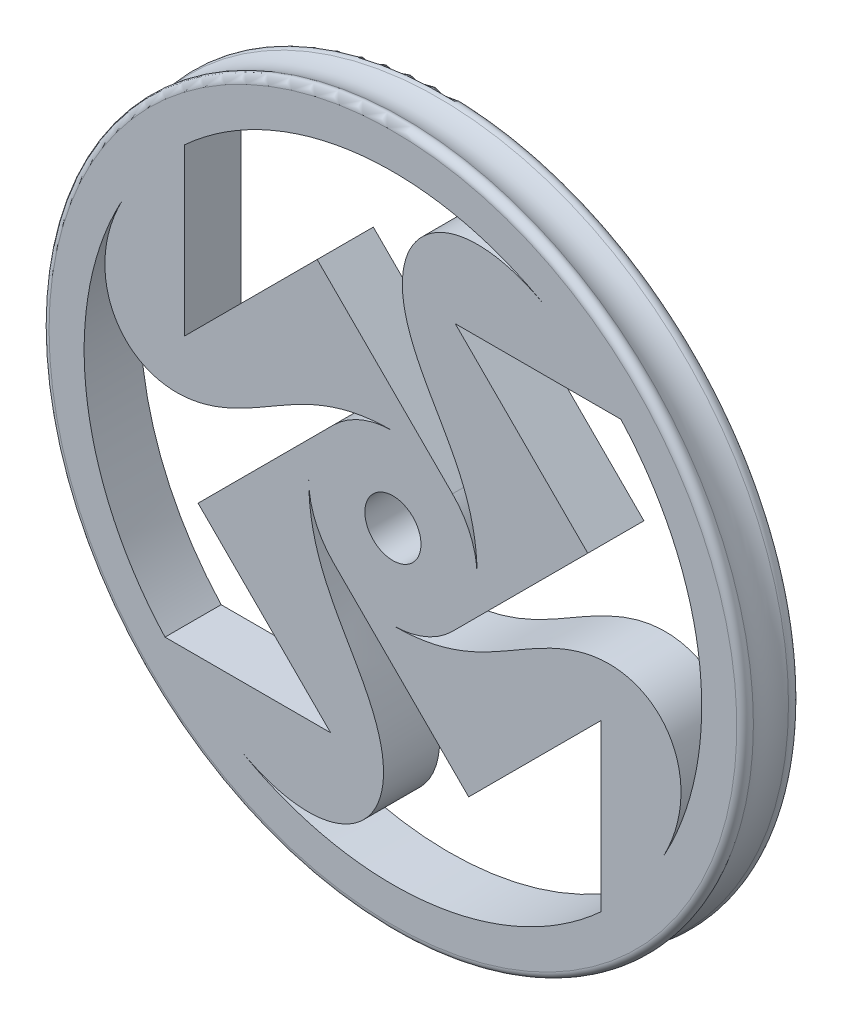
ISO-10303-21;
HEADER;
FILE_DESCRIPTION(('STEP AP214'),'2;1');
FILE_NAME('part.step','',(''),(''),'','','');
FILE_SCHEMA(('AUTOMOTIVE_DESIGN { 1 0 10303 214 1 1 1 1 }'));
ENDSEC;
DATA;
#1=APPLICATION_CONTEXT('core data for automotive mechanical design processes');
#2=APPLICATION_PROTOCOL_DEFINITION('international standard','automotive_design',2000,#1);
#3=PRODUCT_CONTEXT('',#1,'mechanical');
#4=PRODUCT('Part','Part','',(#3));
#5=PRODUCT_RELATED_PRODUCT_CATEGORY('part','',(#4));
#6=PRODUCT_DEFINITION_FORMATION('','',#4);
#7=PRODUCT_DEFINITION_CONTEXT('part definition',#1,'design');
#8=PRODUCT_DEFINITION('design','',#6,#7);
#9=PRODUCT_DEFINITION_SHAPE('','',#8);
#10=(LENGTH_UNIT() NAMED_UNIT(*) SI_UNIT(.MILLI.,.METRE.));
#11=(NAMED_UNIT(*) PLANE_ANGLE_UNIT() SI_UNIT($,.RADIAN.));
#12=(NAMED_UNIT(*) SI_UNIT($,.STERADIAN.) SOLID_ANGLE_UNIT());
#13=UNCERTAINTY_MEASURE_WITH_UNIT(LENGTH_MEASURE(1.E-05),#10,'distance_accuracy_value','');
#14=(GEOMETRIC_REPRESENTATION_CONTEXT(3) GLOBAL_UNCERTAINTY_ASSIGNED_CONTEXT((#13)) GLOBAL_UNIT_ASSIGNED_CONTEXT((#10,
#11,#12)) REPRESENTATION_CONTEXT('',''));
#15=CARTESIAN_POINT('',(0.,0.,0.));
#16=DIRECTION('',(0.,0.,1.));
#17=DIRECTION('',(1.,0.,0.));
#18=AXIS2_PLACEMENT_3D('',#15,#16,#17);
#19=CARTESIAN_POINT('',(0.,3.175,3.175));
#20=DIRECTION('',(0.,0.,1.));
#21=DIRECTION('',(1.,0.,0.));
#22=AXIS2_PLACEMENT_3D('',#19,#20,#21);
#23=PLANE('',#22);
#24=CARTESIAN_POINT('',(0.,0.,3.175));
#25=DIRECTION('',(0.,0.,-1.));
#26=DIRECTION('',(-1.,0.,0.));
#27=AXIS2_PLACEMENT_3D('',#24,#25,#26);
#28=CIRCLE('',#27,3.175);
#29=CARTESIAN_POINT('',(-3.175,0.,3.175));
#30=VERTEX_POINT('',#29);
#31=EDGE_CURVE('E654',#30,#30,#28,.T.);
#32=ORIENTED_EDGE('',*,*,#31,.T.);
#33=EDGE_LOOP('',(#32));
#34=FACE_BOUND('',#33,.T.);
#35=CARTESIAN_POINT('',(0.,0.,3.175));
#36=DIRECTION('',(0.,0.,-1.));
#37=DIRECTION('',(-1.,0.,0.));
#38=AXIS2_PLACEMENT_3D('',#35,#36,#37);
#39=CIRCLE('',#38,38.8968040144766);
#40=CARTESIAN_POINT('',(-38.8968040144766,0.,3.175));
#41=VERTEX_POINT('',#40);
#42=EDGE_CURVE('E12',#41,#41,#39,.T.);
#43=ORIENTED_EDGE('',*,*,#42,.F.);
#44=EDGE_LOOP('',(#43));
#45=FACE_BOUND('',#44,.T.);
#46=CARTESIAN_POINT('',(9.52499999999995,0.,3.175));
#47=CARTESIAN_POINT('',(9.525,16.3007800043497,3.175));
#48=CARTESIAN_POINT('',(-3.7537858617503,16.3007800043497,3.175));
#49=CARTESIAN_POINT('',(-3.75378586175031,32.5859301636656,3.175));
#50=CARTESIAN_POINT('',(6.85977902949857,36.4836641711056,3.175));
#51=CARTESIAN_POINT('',(17.7066361160398,30.1036652661126,3.175));
#52=B_SPLINE_CURVE_WITH_KNOTS('',5,(#46,#47,#48,#49,#50,#51),.UNSPECIFIED.,.F.,.F.,(6,6),(0.,
1.),.UNSPECIFIED.);
#53=CARTESIAN_POINT('',(9.52499999999995,0.,3.175));
#54=VERTEX_POINT('',#53);
#55=CARTESIAN_POINT('',(17.7066361160398,30.1036652661126,3.175));
#56=VERTEX_POINT('',#55);
#57=EDGE_CURVE('E624',#54,#56,#52,.T.);
#58=ORIENTED_EDGE('',*,*,#57,.F.);
#59=CARTESIAN_POINT('',(0.,0.,3.175));
#60=DIRECTION('',(0.,0.,1.));
#61=DIRECTION('',(1.,0.,0.));
#62=AXIS2_PLACEMENT_3D('',#59,#60,#61);
#63=CIRCLE('',#62,9.525);
#64=CARTESIAN_POINT('',(6.73519209080077,6.73519209080086,3.175));
#65=VERTEX_POINT('',#64);
#66=EDGE_CURVE('E620',#54,#65,#63,.T.);
#67=ORIENTED_EDGE('',*,*,#66,.T.);
#68=DIRECTION('',(-0.707106781186552,0.707106781186543,0.));
#69=VECTOR('',#68,1.);
#70=CARTESIAN_POINT('',(6.73519209080077,6.73519209080086,3.175));
#71=LINE('',#70,#69);
#72=CARTESIAN_POINT('',(-8.56875455638826,22.0391387379897,3.175));
#73=VERTEX_POINT('',#72);
#74=EDGE_CURVE('E646',#65,#73,#71,.T.);
#75=ORIENTED_EDGE('',*,*,#74,.T.);
#76=DIRECTION('',(-0.707106781186543,-0.707106781186552,0.));
#77=VECTOR('',#76,1.);
#78=CARTESIAN_POINT('',(-15.303946647189,15.3039466471888,3.175));
#79=LINE('',#78,#77);
#80=CARTESIAN_POINT('',(-23.5603588031436,7.04753449123411,3.175));
#81=VERTEX_POINT('',#80);
#82=EDGE_CURVE('E642',#73,#81,#79,.T.);
#83=ORIENTED_EDGE('',*,*,#82,.T.);
#84=DIRECTION('',(0.,1.,0.));
#85=VECTOR('',#84,1.);
#86=CARTESIAN_POINT('',(-23.5603588031436,0.,3.175));
#87=LINE('',#86,#85);
#88=CARTESIAN_POINT('',(-23.5603588031436,25.7811000166232,3.175));
#89=VERTEX_POINT('',#88);
#90=EDGE_CURVE('E638',#81,#89,#87,.T.);
#91=ORIENTED_EDGE('',*,*,#90,.T.);
#92=CARTESIAN_POINT('',(0.,0.,3.175));
#93=DIRECTION('',(0.,0.,1.));
#94=DIRECTION('',(1.,0.,0.));
#95=AXIS2_PLACEMENT_3D('',#92,#93,#94);
#96=CIRCLE('',#95,34.925);
#97=EDGE_CURVE('E631',#56,#89,#96,.T.);
#98=ORIENTED_EDGE('',*,*,#97,.F.);
#99=EDGE_LOOP('',(#58,#67,#75,#83,#91,#98));
#100=FACE_BOUND('',#99,.T.);
#101=CARTESIAN_POINT('',(-1.05150776711735E-12,9.5249999999989,3.175));
#102=CARTESIAN_POINT('',(-16.3007800043508,9.52499999999895,3.175));
#103=CARTESIAN_POINT('',(-16.3007800043508,-3.75378586175136,3.175));
#104=CARTESIAN_POINT('',(-32.5859301636666,-3.75378586175136,3.175));
#105=CARTESIAN_POINT('',(-36.4836641711066,6.85977902949752,3.175));
#106=CARTESIAN_POINT('',(-30.1036652661137,17.7066361160387,3.175));
#107=B_SPLINE_CURVE_WITH_KNOTS('',5,(#101,#102,#103,#104,#105,#106),.UNSPECIFIED.,.F.,.F.,(6,6),
(0.,1.),.UNSPECIFIED.);
#108=CARTESIAN_POINT('',(-1.05150776711735E-12,9.5249999999989,3.175));
#109=VERTEX_POINT('',#108);
#110=CARTESIAN_POINT('',(-30.1036652661133,17.7066361160385,3.175));
#111=VERTEX_POINT('',#110);
#112=EDGE_CURVE('E715',#109,#111,#107,.T.);
#113=ORIENTED_EDGE('',*,*,#112,.F.);
#114=CARTESIAN_POINT('',(0.,0.,3.175));
#115=DIRECTION('',(0.,0.,1.));
#116=DIRECTION('',(1.,0.,0.));
#117=AXIS2_PLACEMENT_3D('',#114,#115,#116);
#118=CIRCLE('',#117,9.525);
#119=CARTESIAN_POINT('',(-6.73519209080191,6.73519209079972,3.175));
#120=VERTEX_POINT('',#119);
#121=EDGE_CURVE('E403',#109,#120,#118,.T.);
#122=ORIENTED_EDGE('',*,*,#121,.T.);
#123=DIRECTION('',(-0.707106781186543,-0.707106781186552,0.));
#124=VECTOR('',#123,1.);
#125=CARTESIAN_POINT('',(-6.73519209080086,6.73519209080077,3.175));
#126=LINE('',#125,#124);
#127=CARTESIAN_POINT('',(-22.0391387379907,-8.56875455638932,3.175));
#128=VERTEX_POINT('',#127);
#129=EDGE_CURVE('E425',#120,#128,#126,.T.);
#130=ORIENTED_EDGE('',*,*,#129,.T.);
#131=DIRECTION('',(0.707106781186552,-0.707106781186543,0.));
#132=VECTOR('',#131,1.);
#133=CARTESIAN_POINT('',(-15.3039466471899,-15.3039466471901,3.175));
#134=LINE('',#133,#132);
#135=CARTESIAN_POINT('',(-7.04753449123517,-23.5603588031447,3.175));
#136=VERTEX_POINT('',#135);
#137=EDGE_CURVE('E429',#128,#136,#134,.T.);
#138=ORIENTED_EDGE('',*,*,#137,.T.);
#139=DIRECTION('',(-1.,0.,0.));
#140=VECTOR('',#139,1.);
#141=CARTESIAN_POINT('',(0.,-23.5603588031447,3.175));
#142=LINE('',#141,#140);
#143=CARTESIAN_POINT('',(-25.7811000166242,-23.5603588031447,3.175));
#144=VERTEX_POINT('',#143);
#145=EDGE_CURVE('E768',#136,#144,#142,.T.);
#146=ORIENTED_EDGE('',*,*,#145,.T.);
#147=CARTESIAN_POINT('',(0.,0.,3.175));
#148=DIRECTION('',(0.,0.,1.));
#149=DIRECTION('',(1.,0.,0.));
#150=AXIS2_PLACEMENT_3D('',#147,#148,#149);
#151=CIRCLE('',#150,34.925);
#152=EDGE_CURVE('E762',#111,#144,#151,.T.);
#153=ORIENTED_EDGE('',*,*,#152,.F.);
#154=EDGE_LOOP('',(#113,#122,#130,#138,#146,#153));
#155=FACE_BOUND('',#154,.T.);
#156=CARTESIAN_POINT('',(1.05267424319354E-12,-9.525000000001,3.175));
#157=CARTESIAN_POINT('',(16.3007800043508,-9.52500000000105,3.175));
#158=CARTESIAN_POINT('',(16.3007800043508,3.75378586174925,3.175));
#159=CARTESIAN_POINT('',(32.5859301636666,3.75378586174926,3.175));
#160=CARTESIAN_POINT('',(36.4836641711066,-6.85977902949962,3.175));
#161=CARTESIAN_POINT('',(30.1036652661137,-17.7066361160408,3.175));
#162=B_SPLINE_CURVE_WITH_KNOTS('',5,(#156,#157,#158,#159,#160,#161),.UNSPECIFIED.,.F.,.F.,(6,6),
(0.,1.),.UNSPECIFIED.);
#163=CARTESIAN_POINT('',(1.05267424319354E-12,-9.525000000001,3.175));
#164=VERTEX_POINT('',#163);
#165=CARTESIAN_POINT('',(30.1036652661124,-17.7066361160401,3.175));
#166=VERTEX_POINT('',#165);
#167=EDGE_CURVE('E720',#164,#166,#162,.T.);
#168=ORIENTED_EDGE('',*,*,#167,.F.);
#169=CARTESIAN_POINT('',(0.,0.,3.175));
#170=DIRECTION('',(0.,0.,1.));
#171=DIRECTION('',(1.,0.,0.));
#172=AXIS2_PLACEMENT_3D('',#169,#170,#171);
#173=CIRCLE('',#172,9.525);
#174=CARTESIAN_POINT('',(6.73519209080191,-6.73519209080183,3.175));
#175=VERTEX_POINT('',#174);
#176=EDGE_CURVE('E250',#164,#175,#173,.T.);
#177=ORIENTED_EDGE('',*,*,#176,.T.);
#178=DIRECTION('',(0.707106781186543,0.707106781186552,0.));
#179=VECTOR('',#178,1.);
#180=CARTESIAN_POINT('',(6.73519209080191,-6.73519209080183,3.175));
#181=LINE('',#180,#179);
#182=CARTESIAN_POINT('',(22.0391387379907,8.56875455638718,3.175));
#183=VERTEX_POINT('',#182);
#184=EDGE_CURVE('E548',#175,#183,#181,.T.);
#185=ORIENTED_EDGE('',*,*,#184,.T.);
#186=DIRECTION('',(-0.707106781186552,0.707106781186544,0.));
#187=VECTOR('',#186,1.);
#188=CARTESIAN_POINT('',(15.3039466471888,15.303946647189,3.175));
#189=LINE('',#188,#187);
#190=CARTESIAN_POINT('',(7.04753449123517,23.5603588031426,3.175));
#191=VERTEX_POINT('',#190);
#192=EDGE_CURVE('E1039',#183,#191,#189,.T.);
#193=ORIENTED_EDGE('',*,*,#192,.T.);
#194=DIRECTION('',(1.,0.,0.));
#195=VECTOR('',#194,1.);
#196=CARTESIAN_POINT('',(0.,23.5603588031426,3.175));
#197=LINE('',#196,#195);
#198=CARTESIAN_POINT('',(25.7811000166242,23.5603588031426,3.175));
#199=VERTEX_POINT('',#198);
#200=EDGE_CURVE('E1043',#191,#199,#197,.T.);
#201=ORIENTED_EDGE('',*,*,#200,.T.);
#202=CARTESIAN_POINT('',(0.,0.,3.175));
#203=DIRECTION('',(0.,0.,1.));
#204=DIRECTION('',(1.,0.,0.));
#205=AXIS2_PLACEMENT_3D('',#202,#203,#204);
#206=CIRCLE('',#205,34.925);
#207=EDGE_CURVE('E1047',#166,#199,#206,.T.);
#208=ORIENTED_EDGE('',*,*,#207,.F.);
#209=EDGE_LOOP('',(#168,#177,#185,#193,#201,#208));
#210=FACE_BOUND('',#209,.T.);
#211=CARTESIAN_POINT('',(-9.52499999999995,-2.10534848633538E-12,3.175));
#212=CARTESIAN_POINT('',(-9.525,-16.3007800043518,3.175));
#213=CARTESIAN_POINT('',(3.75378586175031,-16.3007800043518,3.175));
#214=CARTESIAN_POINT('',(3.75378586175031,-32.5859301636677,3.175));
#215=CARTESIAN_POINT('',(-6.85977902949857,-36.4836641711077,3.175));
#216=CARTESIAN_POINT('',(-17.7066361160398,-30.1036652661147,3.175));
#217=B_SPLINE_CURVE_WITH_KNOTS('',5,(#211,#212,#213,#214,#215,#216),.UNSPECIFIED.,.F.,.F.,(6,6),
(0.,1.),.UNSPECIFIED.);
#218=CARTESIAN_POINT('',(-9.52499999999995,-2.10534848633538E-12,3.175));
#219=VERTEX_POINT('',#218);
#220=CARTESIAN_POINT('',(-17.7066361160389,-30.1036652661132,3.175));
#221=VERTEX_POINT('',#220);
#222=EDGE_CURVE('E501',#219,#221,#217,.T.);
#223=ORIENTED_EDGE('',*,*,#222,.F.);
#224=CARTESIAN_POINT('',(0.,0.,3.175));
#225=DIRECTION('',(0.,0.,1.));
#226=DIRECTION('',(1.,0.,0.));
#227=AXIS2_PLACEMENT_3D('',#224,#225,#226);
#228=CIRCLE('',#227,9.525);
#229=CARTESIAN_POINT('',(-6.73519209080077,-6.73519209080296,3.175));
#230=VERTEX_POINT('',#229);
#231=EDGE_CURVE('E242',#219,#230,#228,.T.);
#232=ORIENTED_EDGE('',*,*,#231,.T.);
#233=DIRECTION('',(0.707106781186552,-0.707106781186543,0.));
#234=VECTOR('',#233,1.);
#235=CARTESIAN_POINT('',(-6.73519209080182,-6.73519209080191,3.175));
#236=LINE('',#235,#234);
#237=CARTESIAN_POINT('',(8.56875455638826,-22.0391387379918,3.175));
#238=VERTEX_POINT('',#237);
#239=EDGE_CURVE('E523',#230,#238,#236,.T.);
#240=ORIENTED_EDGE('',*,*,#239,.T.);
#241=DIRECTION('',(0.707106781186543,0.707106781186552,0.));
#242=VECTOR('',#241,1.);
#243=CARTESIAN_POINT('',(15.3039466471901,-15.3039466471899,3.175));
#244=LINE('',#243,#242);
#245=CARTESIAN_POINT('',(23.5603588031436,-7.04753449123622,3.175));
#246=VERTEX_POINT('',#245);
#247=EDGE_CURVE('E519',#238,#246,#244,.T.);
#248=ORIENTED_EDGE('',*,*,#247,.T.);
#249=DIRECTION('',(0.,-1.,0.));
#250=VECTOR('',#249,1.);
#251=CARTESIAN_POINT('',(23.5603588031436,0.,3.175));
#252=LINE('',#251,#250);
#253=CARTESIAN_POINT('',(23.5603588031436,-25.7811000166253,3.175));
#254=VERTEX_POINT('',#253);
#255=EDGE_CURVE('E515',#246,#254,#252,.T.);
#256=ORIENTED_EDGE('',*,*,#255,.T.);
#257=CARTESIAN_POINT('',(0.,0.,3.175));
#258=DIRECTION('',(0.,0.,1.));
#259=DIRECTION('',(1.,0.,0.));
#260=AXIS2_PLACEMENT_3D('',#257,#258,#259);
#261=CIRCLE('',#260,34.925);
#262=EDGE_CURVE('E508',#221,#254,#261,.T.);
#263=ORIENTED_EDGE('',*,*,#262,.F.);
#264=EDGE_LOOP('',(#223,#232,#240,#248,#256,#263));
#265=FACE_BOUND('',#264,.T.);
#266=ADVANCED_FACE('F227',(#34,#45,#100,#155,#210,#265),#23,.T.);
#267=CARTESIAN_POINT('',(0.,3.175,-3.175));
#268=DIRECTION('',(0.,0.,-1.));
#269=DIRECTION('',(-1.,0.,0.));
#270=AXIS2_PLACEMENT_3D('',#267,#268,#269);
#271=PLANE('',#270);
#272=CARTESIAN_POINT('',(0.,0.,-3.175));
#273=DIRECTION('',(0.,0.,-1.));
#274=DIRECTION('',(-1.,0.,0.));
#275=AXIS2_PLACEMENT_3D('',#272,#273,#274);
#276=CIRCLE('',#275,38.8968040144766);
#277=CARTESIAN_POINT('',(-38.8968040144766,0.,-3.175));
#278=VERTEX_POINT('',#277);
#279=EDGE_CURVE('E677',#278,#278,#276,.T.);
#280=ORIENTED_EDGE('',*,*,#279,.T.);
#281=EDGE_LOOP('',(#280));
#282=FACE_BOUND('',#281,.T.);
#283=CARTESIAN_POINT('',(0.,0.,-3.175));
#284=DIRECTION('',(0.,0.,-1.));
#285=DIRECTION('',(-1.,0.,0.));
#286=AXIS2_PLACEMENT_3D('',#283,#284,#285);
#287=CIRCLE('',#286,3.175);
#288=CARTESIAN_POINT('',(-3.175,0.,-3.175));
#289=VERTEX_POINT('',#288);
#290=EDGE_CURVE('E673',#289,#289,#287,.T.);
#291=ORIENTED_EDGE('',*,*,#290,.F.);
#292=EDGE_LOOP('',(#291));
#293=FACE_BOUND('',#292,.T.);
#294=DIRECTION('',(-0.707106781186552,0.707106781186543,0.));
#295=VECTOR('',#294,1.);
#296=CARTESIAN_POINT('',(6.73519209080077,6.73519209080086,-3.175));
#297=LINE('',#296,#295);
#298=CARTESIAN_POINT('',(6.73519209080077,6.73519209080086,-3.175));
#299=VERTEX_POINT('',#298);
#300=CARTESIAN_POINT('',(-8.56875455638826,22.0391387379897,-3.175));
#301=VERTEX_POINT('',#300);
#302=EDGE_CURVE('E616',#299,#301,#297,.T.);
#303=ORIENTED_EDGE('',*,*,#302,.F.);
#304=CARTESIAN_POINT('',(0.,0.,-3.175));
#305=DIRECTION('',(0.,0.,1.));
#306=DIRECTION('',(1.,0.,0.));
#307=AXIS2_PLACEMENT_3D('',#304,#305,#306);
#308=CIRCLE('',#307,9.525);
#309=CARTESIAN_POINT('',(9.525,0.,-3.175));
#310=VERTEX_POINT('',#309);
#311=EDGE_CURVE('E602',#310,#299,#308,.T.);
#312=ORIENTED_EDGE('',*,*,#311,.F.);
#313=CARTESIAN_POINT('',(9.52499999999995,0.,-3.175));
#314=CARTESIAN_POINT('',(9.525,16.3007800043497,-3.175));
#315=CARTESIAN_POINT('',(-3.7537858617503,16.3007800043497,-3.175));
#316=CARTESIAN_POINT('',(-3.75378586175031,32.5859301636656,-3.175));
#317=CARTESIAN_POINT('',(6.85977902949857,36.4836641711056,-3.175));
#318=CARTESIAN_POINT('',(17.7066361160398,30.1036652661126,-3.175));
#319=B_SPLINE_CURVE_WITH_KNOTS('',5,(#313,#314,#315,#316,#317,#318),.UNSPECIFIED.,.F.,.F.,(6,6),
(0.,1.),.UNSPECIFIED.);
#320=CARTESIAN_POINT('',(17.7066361160398,30.1036652661126,-3.175));
#321=VERTEX_POINT('',#320);
#322=EDGE_CURVE('E593',#310,#321,#319,.T.);
#323=ORIENTED_EDGE('',*,*,#322,.T.);
#324=CARTESIAN_POINT('',(0.,0.,-3.175));
#325=DIRECTION('',(0.,0.,1.));
#326=DIRECTION('',(1.,0.,0.));
#327=AXIS2_PLACEMENT_3D('',#324,#325,#326);
#328=CIRCLE('',#327,34.925);
#329=CARTESIAN_POINT('',(-23.5603588031436,25.7811000166232,-3.175));
#330=VERTEX_POINT('',#329);
#331=EDGE_CURVE('E601',#321,#330,#328,.T.);
#332=ORIENTED_EDGE('',*,*,#331,.T.);
#333=DIRECTION('',(0.,1.,0.));
#334=VECTOR('',#333,1.);
#335=CARTESIAN_POINT('',(-23.5603588031436,0.,-3.175));
#336=LINE('',#335,#334);
#337=CARTESIAN_POINT('',(-23.5603588031436,7.04753449123411,-3.175));
#338=VERTEX_POINT('',#337);
#339=EDGE_CURVE('E610',#338,#330,#336,.T.);
#340=ORIENTED_EDGE('',*,*,#339,.F.);
#341=DIRECTION('',(-0.707106781186543,-0.707106781186552,0.));
#342=VECTOR('',#341,1.);
#343=CARTESIAN_POINT('',(-15.303946647189,15.3039466471888,-3.175));
#344=LINE('',#343,#342);
#345=EDGE_CURVE('E613',#301,#338,#344,.T.);
#346=ORIENTED_EDGE('',*,*,#345,.F.);
#347=EDGE_LOOP('',(#303,#312,#323,#332,#340,#346));
#348=FACE_BOUND('',#347,.T.);
#349=DIRECTION('',(-0.707106781186543,-0.707106781186552,0.));
#350=VECTOR('',#349,1.);
#351=CARTESIAN_POINT('',(-6.73519209080086,6.73519209080077,-3.175));
#352=LINE('',#351,#350);
#353=CARTESIAN_POINT('',(-6.73519209080191,6.73519209079972,-3.175));
#354=VERTEX_POINT('',#353);
#355=CARTESIAN_POINT('',(-22.0391387379907,-8.56875455638932,-3.175));
#356=VERTEX_POINT('',#355);
#357=EDGE_CURVE('E409',#354,#356,#352,.T.);
#358=ORIENTED_EDGE('',*,*,#357,.F.);
#359=CARTESIAN_POINT('',(0.,0.,-3.175));
#360=DIRECTION('',(0.,0.,1.));
#361=DIRECTION('',(1.,0.,0.));
#362=AXIS2_PLACEMENT_3D('',#359,#360,#361);
#363=CIRCLE('',#362,9.525);
#364=CARTESIAN_POINT('',(-1.05150776711747E-12,9.525,-3.175));
#365=VERTEX_POINT('',#364);
#366=EDGE_CURVE('E400',#365,#354,#363,.T.);
#367=ORIENTED_EDGE('',*,*,#366,.F.);
#368=CARTESIAN_POINT('',(-1.05150776711735E-12,9.5249999999989,-3.175));
#369=CARTESIAN_POINT('',(-16.3007800043508,9.52499999999895,-3.175));
#370=CARTESIAN_POINT('',(-16.3007800043508,-3.75378586175136,-3.175));
#371=CARTESIAN_POINT('',(-32.5859301636666,-3.75378586175136,-3.175));
#372=CARTESIAN_POINT('',(-36.4836641711066,6.85977902949752,-3.175));
#373=CARTESIAN_POINT('',(-30.1036652661137,17.7066361160387,-3.175));
#374=B_SPLINE_CURVE_WITH_KNOTS('',5,(#368,#369,#370,#371,#372,#373),.UNSPECIFIED.,.F.,.F.,(6,6),
(0.,1.),.UNSPECIFIED.);
#375=CARTESIAN_POINT('',(-30.1036652661137,17.7066361160387,-3.175));
#376=VERTEX_POINT('',#375);
#377=EDGE_CURVE('E413',#365,#376,#374,.T.);
#378=ORIENTED_EDGE('',*,*,#377,.T.);
#379=CARTESIAN_POINT('',(0.,0.,-3.175));
#380=DIRECTION('',(0.,0.,1.));
#381=DIRECTION('',(1.,0.,0.));
#382=AXIS2_PLACEMENT_3D('',#379,#380,#381);
#383=CIRCLE('',#382,34.925);
#384=CARTESIAN_POINT('',(-25.7811000166242,-23.5603588031447,-3.175));
#385=VERTEX_POINT('',#384);
#386=EDGE_CURVE('E418',#376,#385,#383,.T.);
#387=ORIENTED_EDGE('',*,*,#386,.T.);
#388=DIRECTION('',(-1.,0.,0.));
#389=VECTOR('',#388,1.);
#390=CARTESIAN_POINT('',(0.,-23.5603588031447,-3.175));
#391=LINE('',#390,#389);
#392=CARTESIAN_POINT('',(-7.04753449123517,-23.5603588031447,-3.175));
#393=VERTEX_POINT('',#392);
#394=EDGE_CURVE('E755',#393,#385,#391,.T.);
#395=ORIENTED_EDGE('',*,*,#394,.F.);
#396=DIRECTION('',(0.707106781186552,-0.707106781186543,0.));
#397=VECTOR('',#396,1.);
#398=CARTESIAN_POINT('',(-15.3039466471899,-15.3039466471901,-3.175));
#399=LINE('',#398,#397);
#400=EDGE_CURVE('E752',#356,#393,#399,.T.);
#401=ORIENTED_EDGE('',*,*,#400,.F.);
#402=EDGE_LOOP('',(#358,#367,#378,#387,#395,#401));
#403=FACE_BOUND('',#402,.T.);
#404=DIRECTION('',(0.707106781186543,0.707106781186552,0.));
#405=VECTOR('',#404,1.);
#406=CARTESIAN_POINT('',(6.73519209080191,-6.73519209080183,-3.175));
#407=LINE('',#406,#405);
#408=CARTESIAN_POINT('',(6.73519209080191,-6.73519209080183,-3.175));
#409=VERTEX_POINT('',#408);
#410=CARTESIAN_POINT('',(22.0391387379907,8.56875455638718,-3.175));
#411=VERTEX_POINT('',#410);
#412=EDGE_CURVE('E1027',#409,#411,#407,.T.);
#413=ORIENTED_EDGE('',*,*,#412,.F.);
#414=CARTESIAN_POINT('',(0.,0.,-3.175));
#415=DIRECTION('',(0.,0.,1.));
#416=DIRECTION('',(1.,0.,0.));
#417=AXIS2_PLACEMENT_3D('',#414,#415,#416);
#418=CIRCLE('',#417,9.525);
#419=CARTESIAN_POINT('',(1.05267424319343E-12,-9.525,-3.175));
#420=VERTEX_POINT('',#419);
#421=EDGE_CURVE('E544',#420,#409,#418,.T.);
#422=ORIENTED_EDGE('',*,*,#421,.F.);
#423=CARTESIAN_POINT('',(1.05267424319354E-12,-9.525000000001,-3.175));
#424=CARTESIAN_POINT('',(16.3007800043508,-9.52500000000105,-3.175));
#425=CARTESIAN_POINT('',(16.3007800043508,3.75378586174925,-3.175));
#426=CARTESIAN_POINT('',(32.5859301636666,3.75378586174926,-3.175));
#427=CARTESIAN_POINT('',(36.4836641711066,-6.85977902949962,-3.175));
#428=CARTESIAN_POINT('',(30.1036652661137,-17.7066361160408,-3.175));
#429=B_SPLINE_CURVE_WITH_KNOTS('',5,(#423,#424,#425,#426,#427,#428),.UNSPECIFIED.,.F.,.F.,(6,6),
(0.,1.),.UNSPECIFIED.);
#430=CARTESIAN_POINT('',(30.1036652661137,-17.7066361160408,-3.175));
#431=VERTEX_POINT('',#430);
#432=EDGE_CURVE('E547',#420,#431,#429,.T.);
#433=ORIENTED_EDGE('',*,*,#432,.T.);
#434=CARTESIAN_POINT('',(0.,0.,-3.175));
#435=DIRECTION('',(0.,0.,1.));
#436=DIRECTION('',(1.,0.,0.));
#437=AXIS2_PLACEMENT_3D('',#434,#435,#436);
#438=CIRCLE('',#437,34.925);
#439=CARTESIAN_POINT('',(25.7811000166242,23.5603588031426,-3.175));
#440=VERTEX_POINT('',#439);
#441=EDGE_CURVE('E555',#431,#440,#438,.T.);
#442=ORIENTED_EDGE('',*,*,#441,.T.);
#443=DIRECTION('',(1.,0.,0.));
#444=VECTOR('',#443,1.);
#445=CARTESIAN_POINT('',(0.,23.5603588031426,-3.175));
#446=LINE('',#445,#444);
#447=CARTESIAN_POINT('',(7.04753449123517,23.5603588031426,-3.175));
#448=VERTEX_POINT('',#447);
#449=EDGE_CURVE('E1032',#448,#440,#446,.T.);
#450=ORIENTED_EDGE('',*,*,#449,.F.);
#451=DIRECTION('',(-0.707106781186552,0.707106781186544,0.));
#452=VECTOR('',#451,1.);
#453=CARTESIAN_POINT('',(15.3039466471888,15.303946647189,-3.175));
#454=LINE('',#453,#452);
#455=EDGE_CURVE('E1029',#411,#448,#454,.T.);
#456=ORIENTED_EDGE('',*,*,#455,.F.);
#457=EDGE_LOOP('',(#413,#422,#433,#442,#450,#456));
#458=FACE_BOUND('',#457,.T.);
#459=DIRECTION('',(0.707106781186552,-0.707106781186543,0.));
#460=VECTOR('',#459,1.);
#461=CARTESIAN_POINT('',(-6.73519209080182,-6.73519209080191,-3.175));
#462=LINE('',#461,#460);
#463=CARTESIAN_POINT('',(-6.73519209080077,-6.73519209080296,-3.175));
#464=VERTEX_POINT('',#463);
#465=CARTESIAN_POINT('',(8.56875455638826,-22.0391387379918,-3.175));
#466=VERTEX_POINT('',#465);
#467=EDGE_CURVE('E495',#464,#466,#462,.T.);
#468=ORIENTED_EDGE('',*,*,#467,.F.);
#469=CARTESIAN_POINT('',(0.,0.,-3.175));
#470=DIRECTION('',(0.,0.,1.));
#471=DIRECTION('',(1.,0.,0.));
#472=AXIS2_PLACEMENT_3D('',#469,#470,#471);
#473=CIRCLE('',#472,9.525);
#474=CARTESIAN_POINT('',(-9.525,-2.10534848633539E-12,-3.175));
#475=VERTEX_POINT('',#474);
#476=EDGE_CURVE('E482',#475,#464,#473,.T.);
#477=ORIENTED_EDGE('',*,*,#476,.F.);
#478=CARTESIAN_POINT('',(-9.52499999999995,-2.10534848633538E-12,-3.175));
#479=CARTESIAN_POINT('',(-9.525,-16.3007800043518,-3.175));
#480=CARTESIAN_POINT('',(3.75378586175031,-16.3007800043518,-3.175));
#481=CARTESIAN_POINT('',(3.75378586175031,-32.5859301636677,-3.175));
#482=CARTESIAN_POINT('',(-6.85977902949857,-36.4836641711077,-3.175));
#483=CARTESIAN_POINT('',(-17.7066361160398,-30.1036652661147,-3.175));
#484=B_SPLINE_CURVE_WITH_KNOTS('',5,(#478,#479,#480,#481,#482,#483),.UNSPECIFIED.,.F.,.F.,(6,6),
(0.,1.),.UNSPECIFIED.);
#485=CARTESIAN_POINT('',(-17.7066361160398,-30.1036652661147,-3.175));
#486=VERTEX_POINT('',#485);
#487=EDGE_CURVE('E473',#475,#486,#484,.T.);
#488=ORIENTED_EDGE('',*,*,#487,.T.);
#489=CARTESIAN_POINT('',(0.,0.,-3.175));
#490=DIRECTION('',(0.,0.,1.));
#491=DIRECTION('',(1.,0.,0.));
#492=AXIS2_PLACEMENT_3D('',#489,#490,#491);
#493=CIRCLE('',#492,34.925);
#494=CARTESIAN_POINT('',(23.5603588031436,-25.7811000166253,-3.175));
#495=VERTEX_POINT('',#494);
#496=EDGE_CURVE('E481',#486,#495,#493,.T.);
#497=ORIENTED_EDGE('',*,*,#496,.T.);
#498=DIRECTION('',(0.,-1.,0.));
#499=VECTOR('',#498,1.);
#500=CARTESIAN_POINT('',(23.5603588031436,0.,-3.175));
#501=LINE('',#500,#499);
#502=CARTESIAN_POINT('',(23.5603588031436,-7.04753449123622,-3.175));
#503=VERTEX_POINT('',#502);
#504=EDGE_CURVE('E489',#503,#495,#501,.T.);
#505=ORIENTED_EDGE('',*,*,#504,.F.);
#506=DIRECTION('',(0.707106781186543,0.707106781186552,0.));
#507=VECTOR('',#506,1.);
#508=CARTESIAN_POINT('',(15.3039466471901,-15.3039466471899,-3.175));
#509=LINE('',#508,#507);
#510=EDGE_CURVE('E492',#466,#503,#509,.T.);
#511=ORIENTED_EDGE('',*,*,#510,.F.);
#512=EDGE_LOOP('',(#468,#477,#488,#497,#505,#511));
#513=FACE_BOUND('',#512,.T.);
#514=ADVANCED_FACE('F421',(#282,#293,#348,#403,#458,#513),#271,.T.);
#515=CARTESIAN_POINT('',(0.,0.,2.38125));
#516=DIRECTION('',(0.,0.,-1.));
#517=DIRECTION('',(-1.,0.,0.));
#518=AXIS2_PLACEMENT_3D('',#515,#516,#517);
#519=TOROIDAL_SURFACE('',#518,38.8968040144766,0.793749999999999);
#520=ORIENTED_EDGE('',*,*,#42,.T.);
#521=EDGE_LOOP('',(#520));
#522=FACE_BOUND('',#521,.T.);
#523=CARTESIAN_POINT('',(0.,0.,1.984375));
#524=DIRECTION('',(0.,0.,-1.));
#525=DIRECTION('',(-1.,0.,0.));
#526=AXIS2_PLACEMENT_3D('',#523,#524,#525);
#527=CIRCLE('',#526,39.5842116787305);
#528=CARTESIAN_POINT('',(-39.5842116787305,0.,1.984375));
#529=VERTEX_POINT('',#528);
#530=EDGE_CURVE('E235',#529,#529,#527,.T.);
#531=ORIENTED_EDGE('',*,*,#530,.F.);
#532=EDGE_LOOP('',(#531));
#533=FACE_BOUND('',#532,.T.);
#534=ADVANCED_FACE('F691',(#522,#533),#519,.T.);
#535=CARTESIAN_POINT('',(0.,0.,0.));
#536=DIRECTION('',(0.,0.,-1.));
#537=DIRECTION('',(-1.,0.,0.));
#538=AXIS2_PLACEMENT_3D('',#535,#536,#537);
#539=TOROIDAL_SURFACE('',#538,43.02125,3.96875);
#540=ORIENTED_EDGE('',*,*,#530,.T.);
#541=EDGE_LOOP('',(#540));
#542=FACE_BOUND('',#541,.T.);
#543=CARTESIAN_POINT('',(0.,0.,-1.984375));
#544=DIRECTION('',(0.,0.,-1.));
#545=DIRECTION('',(-1.,0.,0.));
#546=AXIS2_PLACEMENT_3D('',#543,#544,#545);
#547=CIRCLE('',#546,39.5842116787305);
#548=CARTESIAN_POINT('',(-39.5842116787305,0.,-1.984375));
#549=VERTEX_POINT('',#548);
#550=EDGE_CURVE('E681',#549,#549,#547,.T.);
#551=ORIENTED_EDGE('',*,*,#550,.F.);
#552=EDGE_LOOP('',(#551));
#553=FACE_BOUND('',#552,.T.);
#554=ADVANCED_FACE('F688',(#542,#553),#539,.F.);
#555=CARTESIAN_POINT('',(0.,0.,-2.38125));
#556=DIRECTION('',(0.,0.,-1.));
#557=DIRECTION('',(-1.,0.,0.));
#558=AXIS2_PLACEMENT_3D('',#555,#556,#557);
#559=TOROIDAL_SURFACE('',#558,38.8968040144766,0.793749999999999);
#560=ORIENTED_EDGE('',*,*,#550,.T.);
#561=EDGE_LOOP('',(#560));
#562=FACE_BOUND('',#561,.T.);
#563=ORIENTED_EDGE('',*,*,#279,.F.);
#564=EDGE_LOOP('',(#563));
#565=FACE_BOUND('',#564,.T.);
#566=ADVANCED_FACE('F698',(#562,#565),#559,.T.);
#567=CARTESIAN_POINT('',(0.,0.,-3.4925));
#568=DIRECTION('',(0.,0.,-1.));
#569=DIRECTION('',(-1.,0.,0.));
#570=AXIS2_PLACEMENT_3D('',#567,#568,#569);
#571=CYLINDRICAL_SURFACE('',#570,3.175);
#572=ORIENTED_EDGE('',*,*,#290,.T.);
#573=EDGE_LOOP('',(#572));
#574=FACE_BOUND('',#573,.T.);
#575=ORIENTED_EDGE('',*,*,#31,.F.);
#576=EDGE_LOOP('',(#575));
#577=FACE_BOUND('',#576,.T.);
#578=ADVANCED_FACE('F947',(#574,#577),#571,.F.);
#579=CARTESIAN_POINT('',(0.,0.,-3.175));
#580=DIRECTION('',(0.,0.,1.));
#581=DIRECTION('',(1.,0.,0.));
#582=AXIS2_PLACEMENT_3D('',#579,#580,#581);
#583=CYLINDRICAL_SURFACE('',#582,9.525);
#584=ORIENTED_EDGE('',*,*,#66,.F.);
#585=DIRECTION('',(0.,0.,1.));
#586=VECTOR('',#585,1.);
#587=CARTESIAN_POINT('',(9.525,0.,-3.175));
#588=LINE('',#587,#586);
#589=EDGE_CURVE('E619',#310,#54,#588,.T.);
#590=ORIENTED_EDGE('',*,*,#589,.F.);
#591=ORIENTED_EDGE('',*,*,#311,.T.);
#592=DIRECTION('',(0.,0.,1.));
#593=VECTOR('',#592,1.);
#594=CARTESIAN_POINT('',(6.73519209080077,6.73519209080086,-3.175));
#595=LINE('',#594,#593);
#596=EDGE_CURVE('E650',#299,#65,#595,.T.);
#597=ORIENTED_EDGE('',*,*,#596,.T.);
#598=EDGE_LOOP('',(#584,#590,#591,#597));
#599=FACE_BOUND('',#598,.T.);
#600=ADVANCED_FACE('F575',(#599),#583,.T.);
#601=CARTESIAN_POINT('',(6.73519209080077,6.73519209080086,-3.175));
#602=DIRECTION('',(0.707106781186543,0.707106781186552,0.));
#603=DIRECTION('',(-0.707106781186552,0.707106781186543,0.));
#604=AXIS2_PLACEMENT_3D('',#601,#602,#603);
#605=PLANE('',#604);
#606=ORIENTED_EDGE('',*,*,#74,.F.);
#607=ORIENTED_EDGE('',*,*,#596,.F.);
#608=ORIENTED_EDGE('',*,*,#302,.T.);
#609=DIRECTION('',(0.,0.,1.));
#610=VECTOR('',#609,1.);
#611=CARTESIAN_POINT('',(-8.56875455638826,22.0391387379897,-3.175));
#612=LINE('',#611,#610);
#613=EDGE_CURVE('E655',#301,#73,#612,.T.);
#614=ORIENTED_EDGE('',*,*,#613,.T.);
#615=EDGE_LOOP('',(#606,#607,#608,#614));
#616=FACE_BOUND('',#615,.T.);
#617=ADVANCED_FACE('F571',(#616),#605,.T.);
#618=CARTESIAN_POINT('',(-15.303946647189,15.3039466471888,-3.175));
#619=DIRECTION('',(-0.707106781186552,0.707106781186543,0.));
#620=DIRECTION('',(-0.707106781186543,-0.707106781186552,0.));
#621=AXIS2_PLACEMENT_3D('',#618,#619,#620);
#622=PLANE('',#621);
#623=ORIENTED_EDGE('',*,*,#82,.F.);
#624=ORIENTED_EDGE('',*,*,#613,.F.);
#625=ORIENTED_EDGE('',*,*,#345,.T.);
#626=DIRECTION('',(0.,0.,1.));
#627=VECTOR('',#626,1.);
#628=CARTESIAN_POINT('',(-23.5603588031436,7.04753449123411,-3.175));
#629=LINE('',#628,#627);
#630=EDGE_CURVE('E658',#338,#81,#629,.T.);
#631=ORIENTED_EDGE('',*,*,#630,.T.);
#632=EDGE_LOOP('',(#623,#624,#625,#631));
#633=FACE_BOUND('',#632,.T.);
#634=ADVANCED_FACE('F574',(#633),#622,.T.);
#635=CARTESIAN_POINT('',(-23.5603588031436,0.,-3.175));
#636=DIRECTION('',(1.,0.,0.));
#637=DIRECTION('',(0.,0.,-1.));
#638=AXIS2_PLACEMENT_3D('',#635,#636,#637);
#639=PLANE('',#638);
#640=ORIENTED_EDGE('',*,*,#90,.F.);
#641=ORIENTED_EDGE('',*,*,#630,.F.);
#642=ORIENTED_EDGE('',*,*,#339,.T.);
#643=DIRECTION('',(0.,0.,1.));
#644=VECTOR('',#643,1.);
#645=CARTESIAN_POINT('',(-23.5603588031436,25.7811000166232,-3.175));
#646=LINE('',#645,#644);
#647=EDGE_CURVE('E661',#330,#89,#646,.T.);
#648=ORIENTED_EDGE('',*,*,#647,.T.);
#649=EDGE_LOOP('',(#640,#641,#642,#648));
#650=FACE_BOUND('',#649,.T.);
#651=ADVANCED_FACE('F579',(#650),#639,.T.);
#652=CARTESIAN_POINT('',(0.,0.,-3.175));
#653=DIRECTION('',(0.,0.,1.));
#654=DIRECTION('',(1.,0.,0.));
#655=AXIS2_PLACEMENT_3D('',#652,#653,#654);
#656=CYLINDRICAL_SURFACE('',#655,34.925);
#657=ORIENTED_EDGE('',*,*,#97,.T.);
#658=ORIENTED_EDGE('',*,*,#647,.F.);
#659=ORIENTED_EDGE('',*,*,#331,.F.);
#660=DIRECTION('',(0.,0.,1.));
#661=VECTOR('',#660,1.);
#662=CARTESIAN_POINT('',(17.7066361160398,30.1036652661126,-3.175));
#663=LINE('',#662,#661);
#664=EDGE_CURVE('E664',#321,#56,#663,.T.);
#665=ORIENTED_EDGE('',*,*,#664,.T.);
#666=EDGE_LOOP('',(#657,#658,#659,#665));
#667=FACE_BOUND('',#666,.T.);
#668=ADVANCED_FACE('F583',(#667),#656,.F.);
#669=DIRECTION('',(0.,0.,1.));
#670=VECTOR('',#669,1.);
#671=SURFACE_OF_LINEAR_EXTRUSION('',#319,#670);
#672=ORIENTED_EDGE('',*,*,#57,.T.);
#673=ORIENTED_EDGE('',*,*,#664,.F.);
#674=ORIENTED_EDGE('',*,*,#322,.F.);
#675=ORIENTED_EDGE('',*,*,#589,.T.);
#676=EDGE_LOOP('',(#672,#673,#674,#675));
#677=FACE_BOUND('',#676,.T.);
#678=ADVANCED_FACE('F449',(#677),#671,.F.);
#679=CARTESIAN_POINT('',(0.,0.,-3.175));
#680=DIRECTION('',(0.,0.,1.));
#681=DIRECTION('',(1.,0.,0.));
#682=AXIS2_PLACEMENT_3D('',#679,#680,#681);
#683=CYLINDRICAL_SURFACE('',#682,9.525);
#684=ORIENTED_EDGE('',*,*,#121,.F.);
#685=DIRECTION('',(0.,0.,1.));
#686=VECTOR('',#685,1.);
#687=CARTESIAN_POINT('',(-1.05150776711747E-12,9.525,-3.175));
#688=LINE('',#687,#686);
#689=EDGE_CURVE('E395',#365,#109,#688,.T.);
#690=ORIENTED_EDGE('',*,*,#689,.F.);
#691=ORIENTED_EDGE('',*,*,#366,.T.);
#692=DIRECTION('',(0.,0.,1.));
#693=VECTOR('',#692,1.);
#694=CARTESIAN_POINT('',(-6.73519209080191,6.73519209079972,-3.175));
#695=LINE('',#694,#693);
#696=EDGE_CURVE('E502',#354,#120,#695,.T.);
#697=ORIENTED_EDGE('',*,*,#696,.T.);
#698=EDGE_LOOP('',(#684,#690,#691,#697));
#699=FACE_BOUND('',#698,.T.);
#700=ADVANCED_FACE('F397',(#699),#683,.T.);
#701=CARTESIAN_POINT('',(-6.73519209080086,6.73519209080077,-3.175));
#702=DIRECTION('',(-0.707106781186552,0.707106781186543,0.));
#703=DIRECTION('',(-0.707106781186543,-0.707106781186552,0.));
#704=AXIS2_PLACEMENT_3D('',#701,#702,#703);
#705=PLANE('',#704);
#706=ORIENTED_EDGE('',*,*,#129,.F.);
#707=ORIENTED_EDGE('',*,*,#696,.F.);
#708=ORIENTED_EDGE('',*,*,#357,.T.);
#709=DIRECTION('',(0.,0.,1.));
#710=VECTOR('',#709,1.);
#711=CARTESIAN_POINT('',(-22.0391387379907,-8.56875455638932,-3.175));
#712=LINE('',#711,#710);
#713=EDGE_CURVE('E739',#356,#128,#712,.T.);
#714=ORIENTED_EDGE('',*,*,#713,.T.);
#715=EDGE_LOOP('',(#706,#707,#708,#714));
#716=FACE_BOUND('',#715,.T.);
#717=ADVANCED_FACE('F448',(#716),#705,.T.);
#718=CARTESIAN_POINT('',(-15.3039466471899,-15.3039466471901,-3.175));
#719=DIRECTION('',(-0.707106781186543,-0.707106781186552,0.));
#720=DIRECTION('',(0.707106781186552,-0.707106781186543,0.));
#721=AXIS2_PLACEMENT_3D('',#718,#719,#720);
#722=PLANE('',#721);
#723=ORIENTED_EDGE('',*,*,#137,.F.);
#724=ORIENTED_EDGE('',*,*,#713,.F.);
#725=ORIENTED_EDGE('',*,*,#400,.T.);
#726=DIRECTION('',(0.,0.,1.));
#727=VECTOR('',#726,1.);
#728=CARTESIAN_POINT('',(-7.04753449123517,-23.5603588031447,-3.175));
#729=LINE('',#728,#727);
#730=EDGE_CURVE('E742',#393,#136,#729,.T.);
#731=ORIENTED_EDGE('',*,*,#730,.T.);
#732=EDGE_LOOP('',(#723,#724,#725,#731));
#733=FACE_BOUND('',#732,.T.);
#734=ADVANCED_FACE('F772',(#733),#722,.T.);
#735=CARTESIAN_POINT('',(0.,-23.5603588031447,-3.175));
#736=DIRECTION('',(0.,1.,0.));
#737=DIRECTION('',(-1.,0.,0.));
#738=AXIS2_PLACEMENT_3D('',#735,#736,#737);
#739=PLANE('',#738);
#740=ORIENTED_EDGE('',*,*,#145,.F.);
#741=ORIENTED_EDGE('',*,*,#730,.F.);
#742=ORIENTED_EDGE('',*,*,#394,.T.);
#743=DIRECTION('',(0.,0.,1.));
#744=VECTOR('',#743,1.);
#745=CARTESIAN_POINT('',(-25.7811000166242,-23.5603588031447,-3.175));
#746=LINE('',#745,#744);
#747=EDGE_CURVE('E745',#385,#144,#746,.T.);
#748=ORIENTED_EDGE('',*,*,#747,.T.);
#749=EDGE_LOOP('',(#740,#741,#742,#748));
#750=FACE_BOUND('',#749,.T.);
#751=ADVANCED_FACE('F766',(#750),#739,.T.);
#752=CARTESIAN_POINT('',(0.,0.,-3.175));
#753=DIRECTION('',(0.,0.,1.));
#754=DIRECTION('',(1.,0.,0.));
#755=AXIS2_PLACEMENT_3D('',#752,#753,#754);
#756=CYLINDRICAL_SURFACE('',#755,34.925);
#757=ORIENTED_EDGE('',*,*,#152,.T.);
#758=ORIENTED_EDGE('',*,*,#747,.F.);
#759=ORIENTED_EDGE('',*,*,#386,.F.);
#760=DIRECTION('',(0.,0.,1.));
#761=VECTOR('',#760,1.);
#762=CARTESIAN_POINT('',(-30.1036652661133,17.7066361160385,-3.175));
#763=LINE('',#762,#761);
#764=EDGE_CURVE('E408',#376,#111,#763,.T.);
#765=ORIENTED_EDGE('',*,*,#764,.T.);
#766=EDGE_LOOP('',(#757,#758,#759,#765));
#767=FACE_BOUND('',#766,.T.);
#768=ADVANCED_FACE('F444',(#767),#756,.F.);
#769=DIRECTION('',(0.,0.,1.));
#770=VECTOR('',#769,1.);
#771=SURFACE_OF_LINEAR_EXTRUSION('',#374,#770);
#772=ORIENTED_EDGE('',*,*,#112,.T.);
#773=ORIENTED_EDGE('',*,*,#764,.F.);
#774=ORIENTED_EDGE('',*,*,#377,.F.);
#775=ORIENTED_EDGE('',*,*,#689,.T.);
#776=EDGE_LOOP('',(#772,#773,#774,#775));
#777=FACE_BOUND('',#776,.T.);
#778=ADVANCED_FACE('F414',(#777),#771,.F.);
#779=CARTESIAN_POINT('',(0.,0.,-3.175));
#780=DIRECTION('',(0.,0.,1.));
#781=DIRECTION('',(1.,0.,0.));
#782=AXIS2_PLACEMENT_3D('',#779,#780,#781);
#783=CYLINDRICAL_SURFACE('',#782,9.525);
#784=ORIENTED_EDGE('',*,*,#176,.F.);
#785=DIRECTION('',(0.,0.,1.));
#786=VECTOR('',#785,1.);
#787=CARTESIAN_POINT('',(1.05267424319343E-12,-9.525,-3.175));
#788=LINE('',#787,#786);
#789=EDGE_CURVE('E1024',#420,#164,#788,.T.);
#790=ORIENTED_EDGE('',*,*,#789,.F.);
#791=ORIENTED_EDGE('',*,*,#421,.T.);
#792=DIRECTION('',(0.,0.,1.));
#793=VECTOR('',#792,1.);
#794=CARTESIAN_POINT('',(6.73519209080191,-6.73519209080183,-3.175));
#795=LINE('',#794,#793);
#796=EDGE_CURVE('E625',#409,#175,#795,.T.);
#797=ORIENTED_EDGE('',*,*,#796,.T.);
#798=EDGE_LOOP('',(#784,#790,#791,#797));
#799=FACE_BOUND('',#798,.T.);
#800=ADVANCED_FACE('F443',(#799),#783,.T.);
#801=CARTESIAN_POINT('',(6.73519209080191,-6.73519209080183,-3.175));
#802=DIRECTION('',(0.707106781186552,-0.707106781186543,0.));
#803=DIRECTION('',(0.707106781186543,0.707106781186552,0.));
#804=AXIS2_PLACEMENT_3D('',#801,#802,#803);
#805=PLANE('',#804);
#806=ORIENTED_EDGE('',*,*,#184,.F.);
#807=ORIENTED_EDGE('',*,*,#796,.F.);
#808=ORIENTED_EDGE('',*,*,#412,.T.);
#809=DIRECTION('',(0.,0.,1.));
#810=VECTOR('',#809,1.);
#811=CARTESIAN_POINT('',(22.0391387379907,8.56875455638718,-3.175));
#812=LINE('',#811,#810);
#813=EDGE_CURVE('E1012',#411,#183,#812,.T.);
#814=ORIENTED_EDGE('',*,*,#813,.T.);
#815=EDGE_LOOP('',(#806,#807,#808,#814));
#816=FACE_BOUND('',#815,.T.);
#817=ADVANCED_FACE('F570',(#816),#805,.T.);
#818=CARTESIAN_POINT('',(15.3039466471888,15.303946647189,-3.175));
#819=DIRECTION('',(0.707106781186543,0.707106781186551,0.));
#820=DIRECTION('',(-0.707106781186552,0.707106781186544,0.));
#821=AXIS2_PLACEMENT_3D('',#818,#819,#820);
#822=PLANE('',#821);
#823=ORIENTED_EDGE('',*,*,#192,.F.);
#824=ORIENTED_EDGE('',*,*,#813,.F.);
#825=ORIENTED_EDGE('',*,*,#455,.T.);
#826=DIRECTION('',(0.,0.,1.));
#827=VECTOR('',#826,1.);
#828=CARTESIAN_POINT('',(7.04753449123517,23.5603588031426,-3.175));
#829=LINE('',#828,#827);
#830=EDGE_CURVE('E1015',#448,#191,#829,.T.);
#831=ORIENTED_EDGE('',*,*,#830,.T.);
#832=EDGE_LOOP('',(#823,#824,#825,#831));
#833=FACE_BOUND('',#832,.T.);
#834=ADVANCED_FACE('F816',(#833),#822,.T.);
#835=CARTESIAN_POINT('',(0.,23.5603588031426,-3.175));
#836=DIRECTION('',(0.,-1.,0.));
#837=DIRECTION('',(0.,0.,-1.));
#838=AXIS2_PLACEMENT_3D('',#835,#836,#837);
#839=PLANE('',#838);
#840=ORIENTED_EDGE('',*,*,#200,.F.);
#841=ORIENTED_EDGE('',*,*,#830,.F.);
#842=ORIENTED_EDGE('',*,*,#449,.T.);
#843=DIRECTION('',(0.,0.,1.));
#844=VECTOR('',#843,1.);
#845=CARTESIAN_POINT('',(25.7811000166242,23.5603588031426,-3.175));
#846=LINE('',#845,#844);
#847=EDGE_CURVE('E1018',#440,#199,#846,.T.);
#848=ORIENTED_EDGE('',*,*,#847,.T.);
#849=EDGE_LOOP('',(#840,#841,#842,#848));
#850=FACE_BOUND('',#849,.T.);
#851=ADVANCED_FACE('F823',(#850),#839,.T.);
#852=CARTESIAN_POINT('',(0.,0.,-3.175));
#853=DIRECTION('',(0.,0.,1.));
#854=DIRECTION('',(1.,0.,0.));
#855=AXIS2_PLACEMENT_3D('',#852,#853,#854);
#856=CYLINDRICAL_SURFACE('',#855,34.925);
#857=ORIENTED_EDGE('',*,*,#207,.T.);
#858=ORIENTED_EDGE('',*,*,#847,.F.);
#859=ORIENTED_EDGE('',*,*,#441,.F.);
#860=DIRECTION('',(0.,0.,1.));
#861=VECTOR('',#860,1.);
#862=CARTESIAN_POINT('',(30.1036652661124,-17.7066361160401,-3.175));
#863=LINE('',#862,#861);
#864=EDGE_CURVE('E1021',#431,#166,#863,.T.);
#865=ORIENTED_EDGE('',*,*,#864,.T.);
#866=EDGE_LOOP('',(#857,#858,#859,#865));
#867=FACE_BOUND('',#866,.T.);
#868=ADVANCED_FACE('F565',(#867),#856,.F.);
#869=DIRECTION('',(0.,0.,1.));
#870=VECTOR('',#869,1.);
#871=SURFACE_OF_LINEAR_EXTRUSION('',#429,#870);
#872=ORIENTED_EDGE('',*,*,#167,.T.);
#873=ORIENTED_EDGE('',*,*,#864,.F.);
#874=ORIENTED_EDGE('',*,*,#432,.F.);
#875=ORIENTED_EDGE('',*,*,#789,.T.);
#876=EDGE_LOOP('',(#872,#873,#874,#875));
#877=FACE_BOUND('',#876,.T.);
#878=ADVANCED_FACE('F561',(#877),#871,.F.);
#879=CARTESIAN_POINT('',(0.,0.,-3.175));
#880=DIRECTION('',(0.,0.,1.));
#881=DIRECTION('',(1.,0.,0.));
#882=AXIS2_PLACEMENT_3D('',#879,#880,#881);
#883=CYLINDRICAL_SURFACE('',#882,9.525);
#884=ORIENTED_EDGE('',*,*,#231,.F.);
#885=DIRECTION('',(0.,0.,1.));
#886=VECTOR('',#885,1.);
#887=CARTESIAN_POINT('',(-9.525,-2.10534848633539E-12,-3.175));
#888=LINE('',#887,#886);
#889=EDGE_CURVE('E498',#475,#219,#888,.T.);
#890=ORIENTED_EDGE('',*,*,#889,.F.);
#891=ORIENTED_EDGE('',*,*,#476,.T.);
#892=DIRECTION('',(0.,0.,1.));
#893=VECTOR('',#892,1.);
#894=CARTESIAN_POINT('',(-6.73519209080077,-6.73519209080296,-3.175));
#895=LINE('',#894,#893);
#896=EDGE_CURVE('E527',#464,#230,#895,.T.);
#897=ORIENTED_EDGE('',*,*,#896,.T.);
#898=EDGE_LOOP('',(#884,#890,#891,#897));
#899=FACE_BOUND('',#898,.T.);
#900=ADVANCED_FACE('F454',(#899),#883,.T.);
#901=CARTESIAN_POINT('',(-6.73519209080182,-6.73519209080191,-3.175));
#902=DIRECTION('',(-0.707106781186543,-0.707106781186552,0.));
#903=DIRECTION('',(0.707106781186552,-0.707106781186543,0.));
#904=AXIS2_PLACEMENT_3D('',#901,#902,#903);
#905=PLANE('',#904);
#906=ORIENTED_EDGE('',*,*,#239,.F.);
#907=ORIENTED_EDGE('',*,*,#896,.F.);
#908=ORIENTED_EDGE('',*,*,#467,.T.);
#909=DIRECTION('',(0.,0.,1.));
#910=VECTOR('',#909,1.);
#911=CARTESIAN_POINT('',(8.56875455638826,-22.0391387379918,-3.175));
#912=LINE('',#911,#910);
#913=EDGE_CURVE('E530',#466,#238,#912,.T.);
#914=ORIENTED_EDGE('',*,*,#913,.T.);
#915=EDGE_LOOP('',(#906,#907,#908,#914));
#916=FACE_BOUND('',#915,.T.);
#917=ADVANCED_FACE('F450',(#916),#905,.T.);
#918=CARTESIAN_POINT('',(15.3039466471901,-15.3039466471899,-3.175));
#919=DIRECTION('',(0.707106781186552,-0.707106781186543,0.));
#920=DIRECTION('',(0.707106781186543,0.707106781186552,0.));
#921=AXIS2_PLACEMENT_3D('',#918,#919,#920);
#922=PLANE('',#921);
#923=ORIENTED_EDGE('',*,*,#247,.F.);
#924=ORIENTED_EDGE('',*,*,#913,.F.);
#925=ORIENTED_EDGE('',*,*,#510,.T.);
#926=DIRECTION('',(0.,0.,1.));
#927=VECTOR('',#926,1.);
#928=CARTESIAN_POINT('',(23.5603588031436,-7.04753449123622,-3.175));
#929=LINE('',#928,#927);
#930=EDGE_CURVE('E533',#503,#246,#929,.T.);
#931=ORIENTED_EDGE('',*,*,#930,.T.);
#932=EDGE_LOOP('',(#923,#924,#925,#931));
#933=FACE_BOUND('',#932,.T.);
#934=ADVANCED_FACE('F453',(#933),#922,.T.);
#935=CARTESIAN_POINT('',(23.5603588031436,0.,-3.175));
#936=DIRECTION('',(-1.,0.,0.));
#937=DIRECTION('',(0.,0.,1.));
#938=AXIS2_PLACEMENT_3D('',#935,#936,#937);
#939=PLANE('',#938);
#940=ORIENTED_EDGE('',*,*,#255,.F.);
#941=ORIENTED_EDGE('',*,*,#930,.F.);
#942=ORIENTED_EDGE('',*,*,#504,.T.);
#943=DIRECTION('',(0.,0.,1.));
#944=VECTOR('',#943,1.);
#945=CARTESIAN_POINT('',(23.5603588031436,-25.7811000166253,-3.175));
#946=LINE('',#945,#944);
#947=EDGE_CURVE('E536',#495,#254,#946,.T.);
#948=ORIENTED_EDGE('',*,*,#947,.T.);
#949=EDGE_LOOP('',(#940,#941,#942,#948));
#950=FACE_BOUND('',#949,.T.);
#951=ADVANCED_FACE('F458',(#950),#939,.T.);
#952=CARTESIAN_POINT('',(0.,0.,-3.175));
#953=DIRECTION('',(0.,0.,1.));
#954=DIRECTION('',(1.,0.,0.));
#955=AXIS2_PLACEMENT_3D('',#952,#953,#954);
#956=CYLINDRICAL_SURFACE('',#955,34.925);
#957=ORIENTED_EDGE('',*,*,#262,.T.);
#958=ORIENTED_EDGE('',*,*,#947,.F.);
#959=ORIENTED_EDGE('',*,*,#496,.F.);
#960=DIRECTION('',(0.,0.,1.));
#961=VECTOR('',#960,1.);
#962=CARTESIAN_POINT('',(-17.7066361160389,-30.1036652661132,-3.175));
#963=LINE('',#962,#961);
#964=EDGE_CURVE('E539',#486,#221,#963,.T.);
#965=ORIENTED_EDGE('',*,*,#964,.T.);
#966=EDGE_LOOP('',(#957,#958,#959,#965));
#967=FACE_BOUND('',#966,.T.);
#968=ADVANCED_FACE('F462',(#967),#956,.F.);
#969=DIRECTION('',(0.,0.,1.));
#970=VECTOR('',#969,1.);
#971=SURFACE_OF_LINEAR_EXTRUSION('',#484,#970);
#972=ORIENTED_EDGE('',*,*,#222,.T.);
#973=ORIENTED_EDGE('',*,*,#964,.F.);
#974=ORIENTED_EDGE('',*,*,#487,.F.);
#975=ORIENTED_EDGE('',*,*,#889,.T.);
#976=EDGE_LOOP('',(#972,#973,#974,#975));
#977=FACE_BOUND('',#976,.T.);
#978=ADVANCED_FACE('F466',(#977),#971,.F.);
#979=CLOSED_SHELL('',(#266,#514,#534,#554,#566,#578,#600,#617,#634,#651,#668,#678,#700,#717,
#734,#751,#768,#778,#800,#817,#834,#851,#868,#878,#900,#917,#934,#951,#968,#978));
#980=MANIFOLD_SOLID_BREP('B2',#979);
#981=ADVANCED_BREP_SHAPE_REPRESENTATION('',(#18,#980),#14);
#982=SHAPE_DEFINITION_REPRESENTATION(#9,#981);
ENDSEC;
END-ISO-10303-21;
